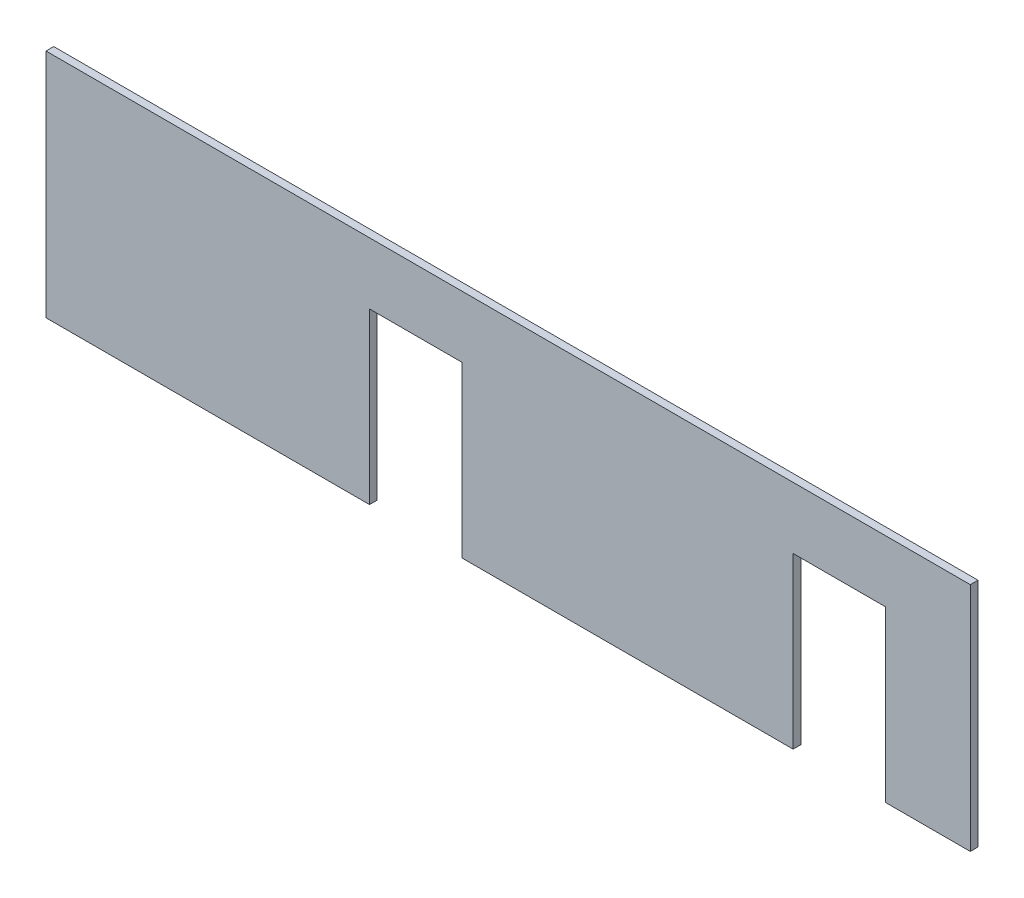
ISO-10303-21;
HEADER;
FILE_DESCRIPTION(('STEP AP214'),'2;1');
FILE_NAME('part.step','',(''),(''),'','','');
FILE_SCHEMA(('AUTOMOTIVE_DESIGN { 1 0 10303 214 1 1 1 1 }'));
ENDSEC;
DATA;
#1=APPLICATION_CONTEXT('core data for automotive mechanical design processes');
#2=APPLICATION_PROTOCOL_DEFINITION('international standard','automotive_design',2000,#1);
#3=PRODUCT_CONTEXT('',#1,'mechanical');
#4=PRODUCT('Part','Part','',(#3));
#5=PRODUCT_RELATED_PRODUCT_CATEGORY('part','',(#4));
#6=PRODUCT_DEFINITION_FORMATION('','',#4);
#7=PRODUCT_DEFINITION_CONTEXT('part definition',#1,'design');
#8=PRODUCT_DEFINITION('design','',#6,#7);
#9=PRODUCT_DEFINITION_SHAPE('','',#8);
#10=(LENGTH_UNIT() NAMED_UNIT(*) SI_UNIT(.MILLI.,.METRE.));
#11=(NAMED_UNIT(*) PLANE_ANGLE_UNIT() SI_UNIT($,.RADIAN.));
#12=(NAMED_UNIT(*) SI_UNIT($,.STERADIAN.) SOLID_ANGLE_UNIT());
#13=UNCERTAINTY_MEASURE_WITH_UNIT(LENGTH_MEASURE(1.E-05),#10,'distance_accuracy_value','');
#14=(GEOMETRIC_REPRESENTATION_CONTEXT(3) GLOBAL_UNCERTAINTY_ASSIGNED_CONTEXT((#13)) GLOBAL_UNIT_ASSIGNED_CONTEXT((#10,
#11,#12)) REPRESENTATION_CONTEXT('',''));
#15=CARTESIAN_POINT('',(0.,0.,0.));
#16=DIRECTION('',(0.,0.,1.));
#17=DIRECTION('',(1.,0.,0.));
#18=AXIS2_PLACEMENT_3D('',#15,#16,#17);
#19=CARTESIAN_POINT('',(245.,-75.0000000000001,5.));
#20=DIRECTION('',(0.,1.,0.));
#21=DIRECTION('',(-1.,0.,0.));
#22=AXIS2_PLACEMENT_3D('',#19,#20,#21);
#23=PLANE('',#22);
#24=DIRECTION('',(1.,0.,0.));
#25=VECTOR('',#24,1.);
#26=CARTESIAN_POINT('',(245.,-75.0000000000001,0.));
#27=LINE('',#26,#25);
#28=CARTESIAN_POINT('',(245.,-75.0000000000001,0.));
#29=VERTEX_POINT('',#28);
#30=CARTESIAN_POINT('',(300.,-75.,0.));
#31=VERTEX_POINT('',#30);
#32=EDGE_CURVE('E153',#29,#31,#27,.T.);
#33=ORIENTED_EDGE('',*,*,#32,.T.);
#34=DIRECTION('',(0.,0.,-1.));
#35=VECTOR('',#34,1.);
#36=CARTESIAN_POINT('',(300.,-75.,5.));
#37=LINE('',#36,#35);
#38=CARTESIAN_POINT('',(300.,-75.,5.));
#39=VERTEX_POINT('',#38);
#40=EDGE_CURVE('E11',#39,#31,#37,.T.);
#41=ORIENTED_EDGE('',*,*,#40,.F.);
#42=DIRECTION('',(1.,0.,0.));
#43=VECTOR('',#42,1.);
#44=CARTESIAN_POINT('',(245.,-75.0000000000001,5.));
#45=LINE('',#44,#43);
#46=CARTESIAN_POINT('',(245.,-75.0000000000001,5.));
#47=VERTEX_POINT('',#46);
#48=EDGE_CURVE('E175',#47,#39,#45,.T.);
#49=ORIENTED_EDGE('',*,*,#48,.F.);
#50=DIRECTION('',(0.,0.,-1.));
#51=VECTOR('',#50,1.);
#52=CARTESIAN_POINT('',(245.,-75.0000000000001,5.));
#53=LINE('',#52,#51);
#54=EDGE_CURVE('E149',#47,#29,#53,.T.);
#55=ORIENTED_EDGE('',*,*,#54,.T.);
#56=EDGE_LOOP('',(#33,#41,#49,#55));
#57=FACE_BOUND('',#56,.T.);
#58=ADVANCED_FACE('F33',(#57),#23,.F.);
#59=CARTESIAN_POINT('',(300.,75.,5.));
#60=DIRECTION('',(-1.,0.,0.));
#61=DIRECTION('',(0.,0.,1.));
#62=AXIS2_PLACEMENT_3D('',#59,#60,#61);
#63=PLANE('',#62);
#64=DIRECTION('',(0.,1.,0.));
#65=VECTOR('',#64,1.);
#66=CARTESIAN_POINT('',(300.,75.,0.));
#67=LINE('',#66,#65);
#68=CARTESIAN_POINT('',(300.,75.,0.));
#69=VERTEX_POINT('',#68);
#70=EDGE_CURVE('E156',#31,#69,#67,.T.);
#71=ORIENTED_EDGE('',*,*,#70,.T.);
#72=DIRECTION('',(0.,0.,-1.));
#73=VECTOR('',#72,1.);
#74=CARTESIAN_POINT('',(300.,75.,5.));
#75=LINE('',#74,#73);
#76=CARTESIAN_POINT('',(300.,75.,5.));
#77=VERTEX_POINT('',#76);
#78=EDGE_CURVE('E41',#77,#69,#75,.T.);
#79=ORIENTED_EDGE('',*,*,#78,.F.);
#80=DIRECTION('',(0.,1.,0.));
#81=VECTOR('',#80,1.);
#82=CARTESIAN_POINT('',(300.,75.,5.));
#83=LINE('',#82,#81);
#84=EDGE_CURVE('E104',#39,#77,#83,.T.);
#85=ORIENTED_EDGE('',*,*,#84,.F.);
#86=ORIENTED_EDGE('',*,*,#40,.T.);
#87=EDGE_LOOP('',(#71,#79,#85,#86));
#88=FACE_BOUND('',#87,.T.);
#89=ADVANCED_FACE('F253',(#88),#63,.F.);
#90=CARTESIAN_POINT('',(-300.,75.,5.));
#91=DIRECTION('',(0.,-1.,0.));
#92=DIRECTION('',(0.,0.,-1.));
#93=AXIS2_PLACEMENT_3D('',#90,#91,#92);
#94=PLANE('',#93);
#95=DIRECTION('',(-1.,0.,0.));
#96=VECTOR('',#95,1.);
#97=CARTESIAN_POINT('',(-300.,75.,0.));
#98=LINE('',#97,#96);
#99=CARTESIAN_POINT('',(-300.,75.,0.));
#100=VERTEX_POINT('',#99);
#101=EDGE_CURVE('E158',#69,#100,#98,.T.);
#102=ORIENTED_EDGE('',*,*,#101,.T.);
#103=DIRECTION('',(0.,0.,-1.));
#104=VECTOR('',#103,1.);
#105=CARTESIAN_POINT('',(-300.,75.,5.));
#106=LINE('',#105,#104);
#107=CARTESIAN_POINT('',(-300.,75.,5.));
#108=VERTEX_POINT('',#107);
#109=EDGE_CURVE('E194',#108,#100,#106,.T.);
#110=ORIENTED_EDGE('',*,*,#109,.F.);
#111=DIRECTION('',(-1.,0.,0.));
#112=VECTOR('',#111,1.);
#113=CARTESIAN_POINT('',(-300.,75.,5.));
#114=LINE('',#113,#112);
#115=EDGE_CURVE('E202',#77,#108,#114,.T.);
#116=ORIENTED_EDGE('',*,*,#115,.F.);
#117=ORIENTED_EDGE('',*,*,#78,.T.);
#118=EDGE_LOOP('',(#102,#110,#116,#117));
#119=FACE_BOUND('',#118,.T.);
#120=ADVANCED_FACE('F200',(#119),#94,.F.);
#121=CARTESIAN_POINT('',(-300.,75.,5.));
#122=DIRECTION('',(1.,0.,0.));
#123=DIRECTION('',(0.,0.,-1.));
#124=AXIS2_PLACEMENT_3D('',#121,#122,#123);
#125=PLANE('',#124);
#126=DIRECTION('',(0.,-1.,0.));
#127=VECTOR('',#126,1.);
#128=CARTESIAN_POINT('',(-300.,75.,0.));
#129=LINE('',#128,#127);
#130=CARTESIAN_POINT('',(-300.,-75.,0.));
#131=VERTEX_POINT('',#130);
#132=EDGE_CURVE('E160',#100,#131,#129,.T.);
#133=ORIENTED_EDGE('',*,*,#132,.T.);
#134=DIRECTION('',(0.,0.,-1.));
#135=VECTOR('',#134,1.);
#136=CARTESIAN_POINT('',(-300.,-75.,5.));
#137=LINE('',#136,#135);
#138=CARTESIAN_POINT('',(-300.,-75.,5.));
#139=VERTEX_POINT('',#138);
#140=EDGE_CURVE('E191',#139,#131,#137,.T.);
#141=ORIENTED_EDGE('',*,*,#140,.F.);
#142=DIRECTION('',(0.,-1.,0.));
#143=VECTOR('',#142,1.);
#144=CARTESIAN_POINT('',(-300.,75.,5.));
#145=LINE('',#144,#143);
#146=EDGE_CURVE('E220',#108,#139,#145,.T.);
#147=ORIENTED_EDGE('',*,*,#146,.F.);
#148=ORIENTED_EDGE('',*,*,#109,.T.);
#149=EDGE_LOOP('',(#133,#141,#147,#148));
#150=FACE_BOUND('',#149,.T.);
#151=ADVANCED_FACE('F211',(#150),#125,.F.);
#152=CARTESIAN_POINT('',(-300.,-75.,5.));
#153=DIRECTION('',(0.,1.,0.));
#154=DIRECTION('',(-1.,0.,0.));
#155=AXIS2_PLACEMENT_3D('',#152,#153,#154);
#156=PLANE('',#155);
#157=DIRECTION('',(1.,0.,0.));
#158=VECTOR('',#157,1.);
#159=CARTESIAN_POINT('',(-300.,-75.,0.));
#160=LINE('',#159,#158);
#161=CARTESIAN_POINT('',(-89.9999999999999,-75.,0.));
#162=VERTEX_POINT('',#161);
#163=EDGE_CURVE('E162',#131,#162,#160,.T.);
#164=ORIENTED_EDGE('',*,*,#163,.T.);
#165=DIRECTION('',(0.,0.,-1.));
#166=VECTOR('',#165,1.);
#167=CARTESIAN_POINT('',(-89.9999999999999,-75.,5.));
#168=LINE('',#167,#166);
#169=CARTESIAN_POINT('',(-89.9999999999999,-75.,5.));
#170=VERTEX_POINT('',#169);
#171=EDGE_CURVE('E188',#170,#162,#168,.T.);
#172=ORIENTED_EDGE('',*,*,#171,.F.);
#173=DIRECTION('',(1.,0.,0.));
#174=VECTOR('',#173,1.);
#175=CARTESIAN_POINT('',(-300.,-75.,5.));
#176=LINE('',#175,#174);
#177=EDGE_CURVE('E217',#139,#170,#176,.T.);
#178=ORIENTED_EDGE('',*,*,#177,.F.);
#179=ORIENTED_EDGE('',*,*,#140,.T.);
#180=EDGE_LOOP('',(#164,#172,#178,#179));
#181=FACE_BOUND('',#180,.T.);
#182=ADVANCED_FACE('F215',(#181),#156,.F.);
#183=CARTESIAN_POINT('',(-90.,35.,5.));
#184=DIRECTION('',(-1.,0.,0.));
#185=DIRECTION('',(0.,-1.,0.));
#186=AXIS2_PLACEMENT_3D('',#183,#184,#185);
#187=PLANE('',#186);
#188=DIRECTION('',(0.,1.,0.));
#189=VECTOR('',#188,1.);
#190=CARTESIAN_POINT('',(-90.,35.,0.));
#191=LINE('',#190,#189);
#192=CARTESIAN_POINT('',(-90.,35.,0.));
#193=VERTEX_POINT('',#192);
#194=EDGE_CURVE('E164',#162,#193,#191,.T.);
#195=ORIENTED_EDGE('',*,*,#194,.T.);
#196=DIRECTION('',(0.,0.,-1.));
#197=VECTOR('',#196,1.);
#198=CARTESIAN_POINT('',(-90.,35.,5.));
#199=LINE('',#198,#197);
#200=CARTESIAN_POINT('',(-90.,35.,5.));
#201=VERTEX_POINT('',#200);
#202=EDGE_CURVE('E185',#201,#193,#199,.T.);
#203=ORIENTED_EDGE('',*,*,#202,.F.);
#204=DIRECTION('',(0.,1.,0.));
#205=VECTOR('',#204,1.);
#206=CARTESIAN_POINT('',(-90.,35.,5.));
#207=LINE('',#206,#205);
#208=EDGE_CURVE('E219',#170,#201,#207,.T.);
#209=ORIENTED_EDGE('',*,*,#208,.F.);
#210=ORIENTED_EDGE('',*,*,#171,.T.);
#211=EDGE_LOOP('',(#195,#203,#209,#210));
#212=FACE_BOUND('',#211,.T.);
#213=ADVANCED_FACE('F266',(#212),#187,.F.);
#214=CARTESIAN_POINT('',(-30.,35.,5.));
#215=DIRECTION('',(0.,1.,0.));
#216=DIRECTION('',(-1.,0.,0.));
#217=AXIS2_PLACEMENT_3D('',#214,#215,#216);
#218=PLANE('',#217);
#219=DIRECTION('',(1.,0.,0.));
#220=VECTOR('',#219,1.);
#221=CARTESIAN_POINT('',(-30.,35.,0.));
#222=LINE('',#221,#220);
#223=CARTESIAN_POINT('',(-30.,35.,0.));
#224=VERTEX_POINT('',#223);
#225=EDGE_CURVE('E166',#193,#224,#222,.T.);
#226=ORIENTED_EDGE('',*,*,#225,.T.);
#227=DIRECTION('',(0.,0.,-1.));
#228=VECTOR('',#227,1.);
#229=CARTESIAN_POINT('',(-30.,35.,5.));
#230=LINE('',#229,#228);
#231=CARTESIAN_POINT('',(-30.,35.,5.));
#232=VERTEX_POINT('',#231);
#233=EDGE_CURVE('E182',#232,#224,#230,.T.);
#234=ORIENTED_EDGE('',*,*,#233,.F.);
#235=DIRECTION('',(1.,0.,0.));
#236=VECTOR('',#235,1.);
#237=CARTESIAN_POINT('',(-30.,35.,5.));
#238=LINE('',#237,#236);
#239=EDGE_CURVE('E222',#201,#232,#238,.T.);
#240=ORIENTED_EDGE('',*,*,#239,.F.);
#241=ORIENTED_EDGE('',*,*,#202,.T.);
#242=EDGE_LOOP('',(#226,#234,#240,#241));
#243=FACE_BOUND('',#242,.T.);
#244=ADVANCED_FACE('F269',(#243),#218,.F.);
#245=CARTESIAN_POINT('',(-29.9999999999999,-75.,5.));
#246=DIRECTION('',(1.,0.,0.));
#247=DIRECTION('',(0.,1.,0.));
#248=AXIS2_PLACEMENT_3D('',#245,#246,#247);
#249=PLANE('',#248);
#250=DIRECTION('',(0.,-1.,0.));
#251=VECTOR('',#250,1.);
#252=CARTESIAN_POINT('',(-29.9999999999999,-75.,0.));
#253=LINE('',#252,#251);
#254=CARTESIAN_POINT('',(-29.9999999999999,-75.,0.));
#255=VERTEX_POINT('',#254);
#256=EDGE_CURVE('E168',#224,#255,#253,.T.);
#257=ORIENTED_EDGE('',*,*,#256,.T.);
#258=DIRECTION('',(0.,0.,-1.));
#259=VECTOR('',#258,1.);
#260=CARTESIAN_POINT('',(-29.9999999999999,-75.,5.));
#261=LINE('',#260,#259);
#262=CARTESIAN_POINT('',(-29.9999999999999,-75.,5.));
#263=VERTEX_POINT('',#262);
#264=EDGE_CURVE('E179',#263,#255,#261,.T.);
#265=ORIENTED_EDGE('',*,*,#264,.F.);
#266=DIRECTION('',(0.,-1.,0.));
#267=VECTOR('',#266,1.);
#268=CARTESIAN_POINT('',(-29.9999999999999,-75.,5.));
#269=LINE('',#268,#267);
#270=EDGE_CURVE('E228',#232,#263,#269,.T.);
#271=ORIENTED_EDGE('',*,*,#270,.F.);
#272=ORIENTED_EDGE('',*,*,#233,.T.);
#273=EDGE_LOOP('',(#257,#265,#271,#272));
#274=FACE_BOUND('',#273,.T.);
#275=ADVANCED_FACE('F234',(#274),#249,.F.);
#276=CARTESIAN_POINT('',(-29.9999999999999,-75.,5.));
#277=DIRECTION('',(0.,1.,0.));
#278=DIRECTION('',(-1.,0.,0.));
#279=AXIS2_PLACEMENT_3D('',#276,#277,#278);
#280=PLANE('',#279);
#281=DIRECTION('',(1.,0.,0.));
#282=VECTOR('',#281,1.);
#283=CARTESIAN_POINT('',(-29.9999999999999,-75.,0.));
#284=LINE('',#283,#282);
#285=CARTESIAN_POINT('',(185.,-75.0000000000001,0.));
#286=VERTEX_POINT('',#285);
#287=EDGE_CURVE('E170',#255,#286,#284,.T.);
#288=ORIENTED_EDGE('',*,*,#287,.T.);
#289=DIRECTION('',(0.,0.,-1.));
#290=VECTOR('',#289,1.);
#291=CARTESIAN_POINT('',(185.,-75.0000000000001,5.));
#292=LINE('',#291,#290);
#293=CARTESIAN_POINT('',(185.,-75.0000000000001,5.));
#294=VERTEX_POINT('',#293);
#295=EDGE_CURVE('E144',#294,#286,#292,.T.);
#296=ORIENTED_EDGE('',*,*,#295,.F.);
#297=DIRECTION('',(1.,0.,0.));
#298=VECTOR('',#297,1.);
#299=CARTESIAN_POINT('',(-29.9999999999999,-75.,5.));
#300=LINE('',#299,#298);
#301=EDGE_CURVE('E135',#263,#294,#300,.T.);
#302=ORIENTED_EDGE('',*,*,#301,.F.);
#303=ORIENTED_EDGE('',*,*,#264,.T.);
#304=EDGE_LOOP('',(#288,#296,#302,#303));
#305=FACE_BOUND('',#304,.T.);
#306=ADVANCED_FACE('F238',(#305),#280,.F.);
#307=CARTESIAN_POINT('',(185.,35.,5.));
#308=DIRECTION('',(-1.,0.,0.));
#309=DIRECTION('',(0.,-1.,0.));
#310=AXIS2_PLACEMENT_3D('',#307,#308,#309);
#311=PLANE('',#310);
#312=DIRECTION('',(0.,1.,0.));
#313=VECTOR('',#312,1.);
#314=CARTESIAN_POINT('',(185.,35.,0.));
#315=LINE('',#314,#313);
#316=CARTESIAN_POINT('',(185.,35.,0.));
#317=VERTEX_POINT('',#316);
#318=EDGE_CURVE('E143',#286,#317,#315,.T.);
#319=ORIENTED_EDGE('',*,*,#318,.T.);
#320=DIRECTION('',(0.,0.,-1.));
#321=VECTOR('',#320,1.);
#322=CARTESIAN_POINT('',(185.,35.,5.));
#323=LINE('',#322,#321);
#324=CARTESIAN_POINT('',(185.,35.,5.));
#325=VERTEX_POINT('',#324);
#326=EDGE_CURVE('E140',#325,#317,#323,.T.);
#327=ORIENTED_EDGE('',*,*,#326,.F.);
#328=DIRECTION('',(0.,1.,0.));
#329=VECTOR('',#328,1.);
#330=CARTESIAN_POINT('',(185.,35.,5.));
#331=LINE('',#330,#329);
#332=EDGE_CURVE('E129',#294,#325,#331,.T.);
#333=ORIENTED_EDGE('',*,*,#332,.F.);
#334=ORIENTED_EDGE('',*,*,#295,.T.);
#335=EDGE_LOOP('',(#319,#327,#333,#334));
#336=FACE_BOUND('',#335,.T.);
#337=ADVANCED_FACE('F141',(#336),#311,.F.);
#338=CARTESIAN_POINT('',(185.,35.,5.));
#339=DIRECTION('',(0.,1.,0.));
#340=DIRECTION('',(-1.,0.,0.));
#341=AXIS2_PLACEMENT_3D('',#338,#339,#340);
#342=PLANE('',#341);
#343=DIRECTION('',(1.,0.,0.));
#344=VECTOR('',#343,1.);
#345=CARTESIAN_POINT('',(185.,35.,0.));
#346=LINE('',#345,#344);
#347=CARTESIAN_POINT('',(245.,35.,0.));
#348=VERTEX_POINT('',#347);
#349=EDGE_CURVE('E90',#317,#348,#346,.T.);
#350=ORIENTED_EDGE('',*,*,#349,.T.);
#351=DIRECTION('',(0.,0.,-1.));
#352=VECTOR('',#351,1.);
#353=CARTESIAN_POINT('',(245.,35.,5.));
#354=LINE('',#353,#352);
#355=CARTESIAN_POINT('',(245.,35.,5.));
#356=VERTEX_POINT('',#355);
#357=EDGE_CURVE('E145',#356,#348,#354,.T.);
#358=ORIENTED_EDGE('',*,*,#357,.F.);
#359=DIRECTION('',(1.,0.,0.));
#360=VECTOR('',#359,1.);
#361=CARTESIAN_POINT('',(185.,35.,5.));
#362=LINE('',#361,#360);
#363=EDGE_CURVE('E133',#325,#356,#362,.T.);
#364=ORIENTED_EDGE('',*,*,#363,.F.);
#365=ORIENTED_EDGE('',*,*,#326,.T.);
#366=EDGE_LOOP('',(#350,#358,#364,#365));
#367=FACE_BOUND('',#366,.T.);
#368=ADVANCED_FACE('F147',(#367),#342,.F.);
#369=CARTESIAN_POINT('',(245.,-75.0000000000001,5.));
#370=DIRECTION('',(1.,0.,0.));
#371=DIRECTION('',(0.,1.,0.));
#372=AXIS2_PLACEMENT_3D('',#369,#370,#371);
#373=PLANE('',#372);
#374=DIRECTION('',(0.,-1.,0.));
#375=VECTOR('',#374,1.);
#376=CARTESIAN_POINT('',(245.,-75.0000000000001,0.));
#377=LINE('',#376,#375);
#378=EDGE_CURVE('E96',#348,#29,#377,.T.);
#379=ORIENTED_EDGE('',*,*,#378,.T.);
#380=ORIENTED_EDGE('',*,*,#54,.F.);
#381=DIRECTION('',(0.,-1.,0.));
#382=VECTOR('',#381,1.);
#383=CARTESIAN_POINT('',(245.,-75.0000000000001,5.));
#384=LINE('',#383,#382);
#385=EDGE_CURVE('E49',#356,#47,#384,.T.);
#386=ORIENTED_EDGE('',*,*,#385,.F.);
#387=ORIENTED_EDGE('',*,*,#357,.T.);
#388=EDGE_LOOP('',(#379,#380,#386,#387));
#389=FACE_BOUND('',#388,.T.);
#390=ADVANCED_FACE('F242',(#389),#373,.F.);
#391=CARTESIAN_POINT('',(0.,0.,5.));
#392=DIRECTION('',(0.,0.,-1.));
#393=DIRECTION('',(-1.,0.,0.));
#394=AXIS2_PLACEMENT_3D('',#391,#392,#393);
#395=PLANE('',#394);
#396=ORIENTED_EDGE('',*,*,#48,.T.);
#397=ORIENTED_EDGE('',*,*,#84,.T.);
#398=ORIENTED_EDGE('',*,*,#115,.T.);
#399=ORIENTED_EDGE('',*,*,#146,.T.);
#400=ORIENTED_EDGE('',*,*,#177,.T.);
#401=ORIENTED_EDGE('',*,*,#208,.T.);
#402=ORIENTED_EDGE('',*,*,#239,.T.);
#403=ORIENTED_EDGE('',*,*,#270,.T.);
#404=ORIENTED_EDGE('',*,*,#301,.T.);
#405=ORIENTED_EDGE('',*,*,#332,.T.);
#406=ORIENTED_EDGE('',*,*,#363,.T.);
#407=ORIENTED_EDGE('',*,*,#385,.T.);
#408=EDGE_LOOP('',(#396,#397,#398,#399,#400,#401,#402,#403,#404,#405,#406,#407));
#409=FACE_BOUND('',#408,.T.);
#410=ADVANCED_FACE('F131',(#409),#395,.F.);
#411=CARTESIAN_POINT('',(0.,0.,0.));
#412=DIRECTION('',(0.,0.,-1.));
#413=DIRECTION('',(-1.,0.,0.));
#414=AXIS2_PLACEMENT_3D('',#411,#412,#413);
#415=PLANE('',#414);
#416=ORIENTED_EDGE('',*,*,#32,.F.);
#417=ORIENTED_EDGE('',*,*,#378,.F.);
#418=ORIENTED_EDGE('',*,*,#349,.F.);
#419=ORIENTED_EDGE('',*,*,#318,.F.);
#420=ORIENTED_EDGE('',*,*,#287,.F.);
#421=ORIENTED_EDGE('',*,*,#256,.F.);
#422=ORIENTED_EDGE('',*,*,#225,.F.);
#423=ORIENTED_EDGE('',*,*,#194,.F.);
#424=ORIENTED_EDGE('',*,*,#163,.F.);
#425=ORIENTED_EDGE('',*,*,#132,.F.);
#426=ORIENTED_EDGE('',*,*,#101,.F.);
#427=ORIENTED_EDGE('',*,*,#70,.F.);
#428=EDGE_LOOP('',(#416,#417,#418,#419,#420,#421,#422,#423,#424,#425,#426,#427));
#429=FACE_BOUND('',#428,.T.);
#430=ADVANCED_FACE('F206',(#429),#415,.T.);
#431=CLOSED_SHELL('',(#58,#89,#120,#151,#182,#213,#244,#275,#306,#337,#368,#390,#410,#430));
#432=MANIFOLD_SOLID_BREP('B2',#431);
#433=ADVANCED_BREP_SHAPE_REPRESENTATION('',(#18,#432),#14);
#434=SHAPE_DEFINITION_REPRESENTATION(#9,#433);
ENDSEC;
END-ISO-10303-21;
